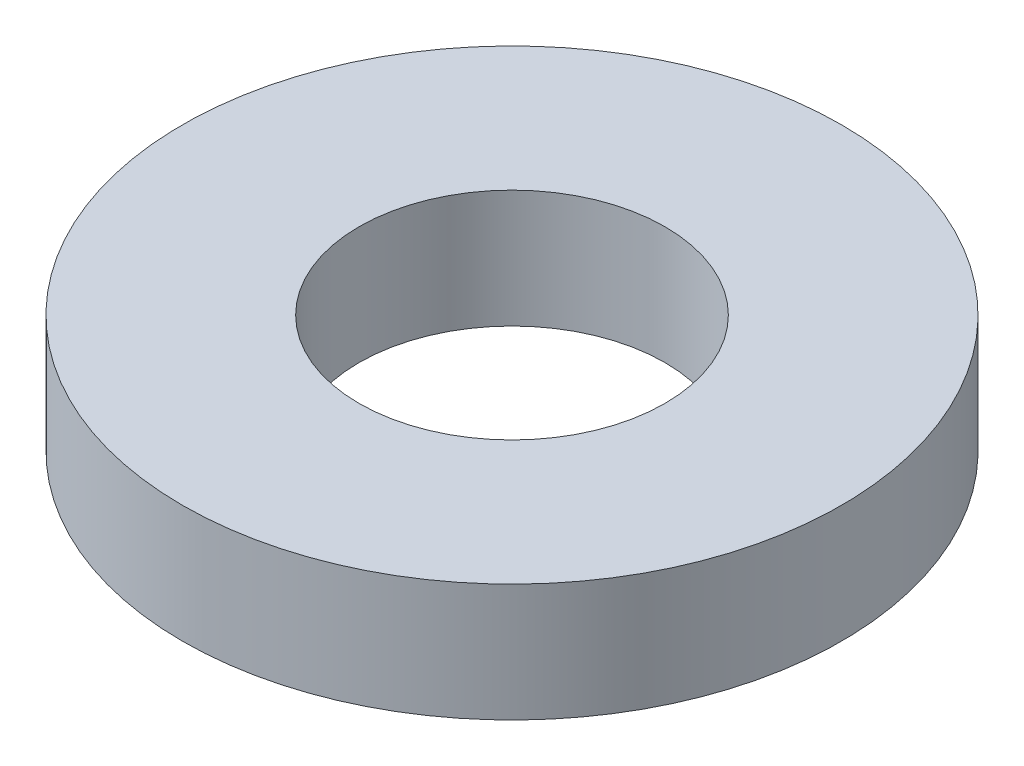
ISO-10303-21;
HEADER;
FILE_DESCRIPTION(('STEP AP214'),'2;1');
FILE_NAME('part.step','',(''),(''),'','','');
FILE_SCHEMA(('AUTOMOTIVE_DESIGN { 1 0 10303 214 1 1 1 1 }'));
ENDSEC;
DATA;
#1=APPLICATION_CONTEXT('core data for automotive mechanical design processes');
#2=APPLICATION_PROTOCOL_DEFINITION('international standard','automotive_design',2000,#1);
#3=PRODUCT_CONTEXT('',#1,'mechanical');
#4=PRODUCT('Part','Part','',(#3));
#5=PRODUCT_RELATED_PRODUCT_CATEGORY('part','',(#4));
#6=PRODUCT_DEFINITION_FORMATION('','',#4);
#7=PRODUCT_DEFINITION_CONTEXT('part definition',#1,'design');
#8=PRODUCT_DEFINITION('design','',#6,#7);
#9=PRODUCT_DEFINITION_SHAPE('','',#8);
#10=(LENGTH_UNIT() NAMED_UNIT(*) SI_UNIT(.MILLI.,.METRE.));
#11=(NAMED_UNIT(*) PLANE_ANGLE_UNIT() SI_UNIT($,.RADIAN.));
#12=(NAMED_UNIT(*) SI_UNIT($,.STERADIAN.) SOLID_ANGLE_UNIT());
#13=UNCERTAINTY_MEASURE_WITH_UNIT(LENGTH_MEASURE(1.E-05),#10,'distance_accuracy_value','');
#14=(GEOMETRIC_REPRESENTATION_CONTEXT(3) GLOBAL_UNCERTAINTY_ASSIGNED_CONTEXT((#13)) GLOBAL_UNIT_ASSIGNED_CONTEXT((#10,
#11,#12)) REPRESENTATION_CONTEXT('',''));
#15=CARTESIAN_POINT('',(0.,0.,0.));
#16=DIRECTION('',(0.,0.,1.));
#17=DIRECTION('',(1.,0.,0.));
#18=AXIS2_PLACEMENT_3D('',#15,#16,#17);
#19=CARTESIAN_POINT('',(0.,25.,0.));
#20=DIRECTION('',(0.,-1.,0.));
#21=DIRECTION('',(0.,0.,-1.));
#22=AXIS2_PLACEMENT_3D('',#19,#20,#21);
#23=CYLINDRICAL_SURFACE('',#22,70.);
#24=CARTESIAN_POINT('',(0.,25.,0.));
#25=DIRECTION('',(0.,1.,0.));
#26=DIRECTION('',(0.,0.,1.));
#27=AXIS2_PLACEMENT_3D('',#24,#25,#26);
#28=CIRCLE('',#27,70.);
#29=CARTESIAN_POINT('',(0.,25.,70.));
#30=VERTEX_POINT('',#29);
#31=EDGE_CURVE('E10',#30,#30,#28,.T.);
#32=ORIENTED_EDGE('',*,*,#31,.F.);
#33=EDGE_LOOP('',(#32));
#34=FACE_BOUND('',#33,.T.);
#35=CARTESIAN_POINT('',(0.,0.,0.));
#36=DIRECTION('',(0.,1.,0.));
#37=DIRECTION('',(0.,0.,1.));
#38=AXIS2_PLACEMENT_3D('',#35,#36,#37);
#39=CIRCLE('',#38,70.);
#40=CARTESIAN_POINT('',(0.,0.,70.));
#41=VERTEX_POINT('',#40);
#42=EDGE_CURVE('E37',#41,#41,#39,.T.);
#43=ORIENTED_EDGE('',*,*,#42,.T.);
#44=EDGE_LOOP('',(#43));
#45=FACE_BOUND('',#44,.T.);
#46=ADVANCED_FACE('F40',(#34,#45),#23,.T.);
#47=CARTESIAN_POINT('',(0.,25.,0.));
#48=DIRECTION('',(0.,1.,0.));
#49=DIRECTION('',(0.,0.,1.));
#50=AXIS2_PLACEMENT_3D('',#47,#48,#49);
#51=PLANE('',#50);
#52=CARTESIAN_POINT('',(0.,25.,0.));
#53=DIRECTION('',(0.,1.,0.));
#54=DIRECTION('',(0.,0.,1.));
#55=AXIS2_PLACEMENT_3D('',#52,#53,#54);
#56=CIRCLE('',#55,32.5);
#57=CARTESIAN_POINT('',(0.,25.,32.5));
#58=VERTEX_POINT('',#57);
#59=EDGE_CURVE('E50',#58,#58,#56,.T.);
#60=ORIENTED_EDGE('',*,*,#59,.F.);
#61=EDGE_LOOP('',(#60));
#62=FACE_BOUND('',#61,.T.);
#63=ORIENTED_EDGE('',*,*,#31,.T.);
#64=EDGE_LOOP('',(#63));
#65=FACE_BOUND('',#64,.T.);
#66=ADVANCED_FACE('F59',(#62,#65),#51,.T.);
#67=CARTESIAN_POINT('',(0.,0.,0.));
#68=DIRECTION('',(0.,1.,0.));
#69=DIRECTION('',(0.,0.,1.));
#70=AXIS2_PLACEMENT_3D('',#67,#68,#69);
#71=PLANE('',#70);
#72=CARTESIAN_POINT('',(0.,0.,0.));
#73=DIRECTION('',(0.,1.,0.));
#74=DIRECTION('',(0.,0.,1.));
#75=AXIS2_PLACEMENT_3D('',#72,#73,#74);
#76=CIRCLE('',#75,32.5);
#77=CARTESIAN_POINT('',(0.,0.,32.5));
#78=VERTEX_POINT('',#77);
#79=EDGE_CURVE('E47',#78,#78,#76,.T.);
#80=ORIENTED_EDGE('',*,*,#79,.T.);
#81=EDGE_LOOP('',(#80));
#82=FACE_BOUND('',#81,.T.);
#83=ORIENTED_EDGE('',*,*,#42,.F.);
#84=EDGE_LOOP('',(#83));
#85=FACE_BOUND('',#84,.T.);
#86=ADVANCED_FACE('F58',(#82,#85),#71,.F.);
#87=CARTESIAN_POINT('',(0.,25.,0.));
#88=DIRECTION('',(0.,-1.,0.));
#89=DIRECTION('',(0.,0.,-1.));
#90=AXIS2_PLACEMENT_3D('',#87,#88,#89);
#91=CYLINDRICAL_SURFACE('',#90,32.5);
#92=ORIENTED_EDGE('',*,*,#59,.T.);
#93=EDGE_LOOP('',(#92));
#94=FACE_BOUND('',#93,.T.);
#95=ORIENTED_EDGE('',*,*,#79,.F.);
#96=EDGE_LOOP('',(#95));
#97=FACE_BOUND('',#96,.T.);
#98=ADVANCED_FACE('F54',(#94,#97),#91,.F.);
#99=CLOSED_SHELL('',(#46,#66,#86,#98));
#100=MANIFOLD_SOLID_BREP('B2',#99);
#101=ADVANCED_BREP_SHAPE_REPRESENTATION('',(#18,#100),#14);
#102=SHAPE_DEFINITION_REPRESENTATION(#9,#101);
ENDSEC;
END-ISO-10303-21;
